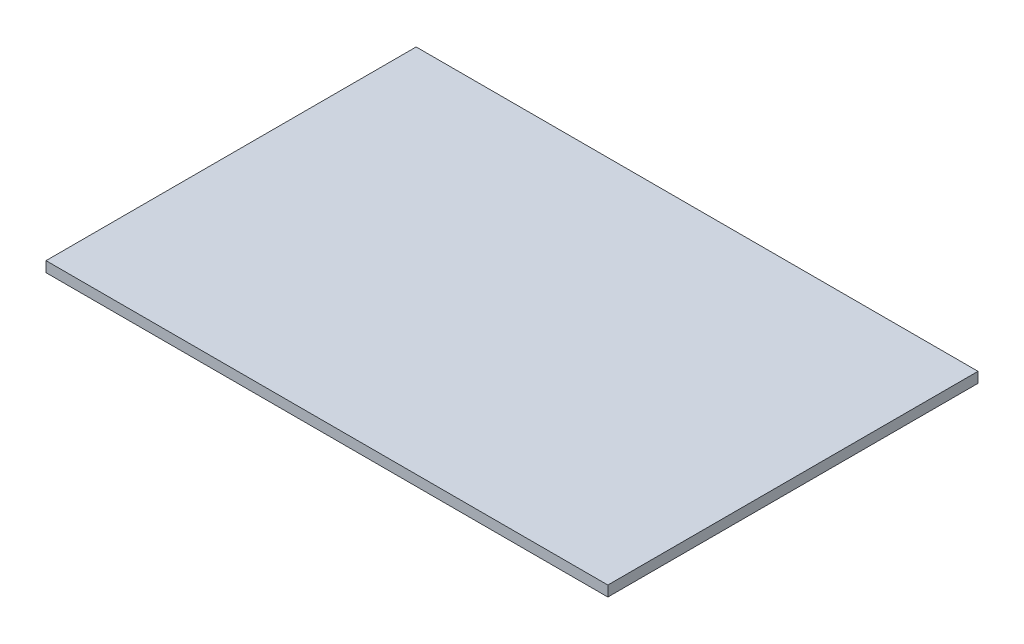
ISO-10303-21;
HEADER;
FILE_DESCRIPTION(('STEP AP214'),'2;1');
FILE_NAME('part.step','',(''),(''),'','','');
FILE_SCHEMA(('AUTOMOTIVE_DESIGN { 1 0 10303 214 1 1 1 1 }'));
ENDSEC;
DATA;
#1=APPLICATION_CONTEXT('core data for automotive mechanical design processes');
#2=APPLICATION_PROTOCOL_DEFINITION('international standard','automotive_design',2000,#1);
#3=PRODUCT_CONTEXT('',#1,'mechanical');
#4=PRODUCT('Part','Part','',(#3));
#5=PRODUCT_RELATED_PRODUCT_CATEGORY('part','',(#4));
#6=PRODUCT_DEFINITION_FORMATION('','',#4);
#7=PRODUCT_DEFINITION_CONTEXT('part definition',#1,'design');
#8=PRODUCT_DEFINITION('design','',#6,#7);
#9=PRODUCT_DEFINITION_SHAPE('','',#8);
#10=(LENGTH_UNIT() NAMED_UNIT(*) SI_UNIT(.MILLI.,.METRE.));
#11=(NAMED_UNIT(*) PLANE_ANGLE_UNIT() SI_UNIT($,.RADIAN.));
#12=(NAMED_UNIT(*) SI_UNIT($,.STERADIAN.) SOLID_ANGLE_UNIT());
#13=UNCERTAINTY_MEASURE_WITH_UNIT(LENGTH_MEASURE(1.E-05),#10,'distance_accuracy_value','');
#14=(GEOMETRIC_REPRESENTATION_CONTEXT(3) GLOBAL_UNCERTAINTY_ASSIGNED_CONTEXT((#13)) GLOBAL_UNIT_ASSIGNED_CONTEXT((#10,
#11,#12)) REPRESENTATION_CONTEXT('',''));
#15=CARTESIAN_POINT('',(0.,0.,0.));
#16=DIRECTION('',(0.,0.,1.));
#17=DIRECTION('',(1.,0.,0.));
#18=AXIS2_PLACEMENT_3D('',#15,#16,#17);
#19=CARTESIAN_POINT('',(-539.75,20.066,355.6));
#20=DIRECTION('',(1.,0.,0.));
#21=DIRECTION('',(0.,0.,-1.));
#22=AXIS2_PLACEMENT_3D('',#19,#20,#21);
#23=PLANE('',#22);
#24=DIRECTION('',(0.,0.,1.));
#25=VECTOR('',#24,1.);
#26=CARTESIAN_POINT('',(-539.75,0.,355.6));
#27=LINE('',#26,#25);
#28=CARTESIAN_POINT('',(-539.75,0.,-355.6));
#29=VERTEX_POINT('',#28);
#30=CARTESIAN_POINT('',(-539.75,0.,355.6));
#31=VERTEX_POINT('',#30);
#32=EDGE_CURVE('E99',#29,#31,#27,.T.);
#33=ORIENTED_EDGE('',*,*,#32,.T.);
#34=DIRECTION('',(0.,-1.,0.));
#35=VECTOR('',#34,1.);
#36=CARTESIAN_POINT('',(-539.75,20.066,355.6));
#37=LINE('',#36,#35);
#38=CARTESIAN_POINT('',(-539.75,20.066,355.6));
#39=VERTEX_POINT('',#38);
#40=EDGE_CURVE('E11',#39,#31,#37,.T.);
#41=ORIENTED_EDGE('',*,*,#40,.F.);
#42=DIRECTION('',(0.,0.,1.));
#43=VECTOR('',#42,1.);
#44=CARTESIAN_POINT('',(-539.75,20.066,355.6));
#45=LINE('',#44,#43);
#46=CARTESIAN_POINT('',(-539.75,20.066,-355.6));
#47=VERTEX_POINT('',#46);
#48=EDGE_CURVE('E87',#47,#39,#45,.T.);
#49=ORIENTED_EDGE('',*,*,#48,.F.);
#50=DIRECTION('',(0.,-1.,0.));
#51=VECTOR('',#50,1.);
#52=CARTESIAN_POINT('',(-539.75,20.066,-355.6));
#53=LINE('',#52,#51);
#54=EDGE_CURVE('E95',#47,#29,#53,.T.);
#55=ORIENTED_EDGE('',*,*,#54,.T.);
#56=EDGE_LOOP('',(#33,#41,#49,#55));
#57=FACE_BOUND('',#56,.T.);
#58=ADVANCED_FACE('F36',(#57),#23,.F.);
#59=CARTESIAN_POINT('',(539.75,20.066,355.6));
#60=DIRECTION('',(0.,0.,-1.));
#61=DIRECTION('',(-1.,0.,0.));
#62=AXIS2_PLACEMENT_3D('',#59,#60,#61);
#63=PLANE('',#62);
#64=DIRECTION('',(1.,0.,0.));
#65=VECTOR('',#64,1.);
#66=CARTESIAN_POINT('',(539.75,0.,355.6));
#67=LINE('',#66,#65);
#68=CARTESIAN_POINT('',(539.75,0.,355.6));
#69=VERTEX_POINT('',#68);
#70=EDGE_CURVE('E91',#31,#69,#67,.T.);
#71=ORIENTED_EDGE('',*,*,#70,.T.);
#72=DIRECTION('',(0.,-1.,0.));
#73=VECTOR('',#72,1.);
#74=CARTESIAN_POINT('',(539.75,20.066,355.6));
#75=LINE('',#74,#73);
#76=CARTESIAN_POINT('',(539.75,20.066,355.6));
#77=VERTEX_POINT('',#76);
#78=EDGE_CURVE('E44',#77,#69,#75,.T.);
#79=ORIENTED_EDGE('',*,*,#78,.F.);
#80=DIRECTION('',(1.,0.,0.));
#81=VECTOR('',#80,1.);
#82=CARTESIAN_POINT('',(539.75,20.066,355.6));
#83=LINE('',#82,#81);
#84=EDGE_CURVE('E82',#39,#77,#83,.T.);
#85=ORIENTED_EDGE('',*,*,#84,.F.);
#86=ORIENTED_EDGE('',*,*,#40,.T.);
#87=EDGE_LOOP('',(#71,#79,#85,#86));
#88=FACE_BOUND('',#87,.T.);
#89=ADVANCED_FACE('F90',(#88),#63,.F.);
#90=CARTESIAN_POINT('',(539.75,20.066,355.6));
#91=DIRECTION('',(-1.,0.,0.));
#92=DIRECTION('',(0.,0.,1.));
#93=AXIS2_PLACEMENT_3D('',#90,#91,#92);
#94=PLANE('',#93);
#95=DIRECTION('',(0.,0.,-1.));
#96=VECTOR('',#95,1.);
#97=CARTESIAN_POINT('',(539.75,0.,355.6));
#98=LINE('',#97,#96);
#99=CARTESIAN_POINT('',(539.75,0.,-355.6));
#100=VERTEX_POINT('',#99);
#101=EDGE_CURVE('E69',#69,#100,#98,.T.);
#102=ORIENTED_EDGE('',*,*,#101,.T.);
#103=DIRECTION('',(0.,-1.,0.));
#104=VECTOR('',#103,1.);
#105=CARTESIAN_POINT('',(539.75,20.066,-355.6));
#106=LINE('',#105,#104);
#107=CARTESIAN_POINT('',(539.75,20.066,-355.6));
#108=VERTEX_POINT('',#107);
#109=EDGE_CURVE('E92',#108,#100,#106,.T.);
#110=ORIENTED_EDGE('',*,*,#109,.F.);
#111=DIRECTION('',(0.,0.,-1.));
#112=VECTOR('',#111,1.);
#113=CARTESIAN_POINT('',(539.75,20.066,355.6));
#114=LINE('',#113,#112);
#115=EDGE_CURVE('E85',#77,#108,#114,.T.);
#116=ORIENTED_EDGE('',*,*,#115,.F.);
#117=ORIENTED_EDGE('',*,*,#78,.T.);
#118=EDGE_LOOP('',(#102,#110,#116,#117));
#119=FACE_BOUND('',#118,.T.);
#120=ADVANCED_FACE('F93',(#119),#94,.F.);
#121=CARTESIAN_POINT('',(539.75,20.066,-355.6));
#122=DIRECTION('',(0.,0.,1.));
#123=DIRECTION('',(1.,0.,0.));
#124=AXIS2_PLACEMENT_3D('',#121,#122,#123);
#125=PLANE('',#124);
#126=DIRECTION('',(-1.,0.,0.));
#127=VECTOR('',#126,1.);
#128=CARTESIAN_POINT('',(539.75,0.,-355.6));
#129=LINE('',#128,#127);
#130=EDGE_CURVE('E75',#100,#29,#129,.T.);
#131=ORIENTED_EDGE('',*,*,#130,.T.);
#132=ORIENTED_EDGE('',*,*,#54,.F.);
#133=DIRECTION('',(-1.,0.,0.));
#134=VECTOR('',#133,1.);
#135=CARTESIAN_POINT('',(539.75,20.066,-355.6));
#136=LINE('',#135,#134);
#137=EDGE_CURVE('E52',#108,#47,#136,.T.);
#138=ORIENTED_EDGE('',*,*,#137,.F.);
#139=ORIENTED_EDGE('',*,*,#109,.T.);
#140=EDGE_LOOP('',(#131,#132,#138,#139));
#141=FACE_BOUND('',#140,.T.);
#142=ADVANCED_FACE('F106',(#141),#125,.F.);
#143=CARTESIAN_POINT('',(0.,20.066,0.));
#144=DIRECTION('',(0.,1.,0.));
#145=DIRECTION('',(0.,0.,1.));
#146=AXIS2_PLACEMENT_3D('',#143,#144,#145);
#147=PLANE('',#146);
#148=ORIENTED_EDGE('',*,*,#48,.T.);
#149=ORIENTED_EDGE('',*,*,#84,.T.);
#150=ORIENTED_EDGE('',*,*,#115,.T.);
#151=ORIENTED_EDGE('',*,*,#137,.T.);
#152=EDGE_LOOP('',(#148,#149,#150,#151));
#153=FACE_BOUND('',#152,.T.);
#154=ADVANCED_FACE('F83',(#153),#147,.T.);
#155=CARTESIAN_POINT('',(0.,0.,0.));
#156=DIRECTION('',(0.,1.,0.));
#157=DIRECTION('',(0.,0.,1.));
#158=AXIS2_PLACEMENT_3D('',#155,#156,#157);
#159=PLANE('',#158);
#160=ORIENTED_EDGE('',*,*,#32,.F.);
#161=ORIENTED_EDGE('',*,*,#130,.F.);
#162=ORIENTED_EDGE('',*,*,#101,.F.);
#163=ORIENTED_EDGE('',*,*,#70,.F.);
#164=EDGE_LOOP('',(#160,#161,#162,#163));
#165=FACE_BOUND('',#164,.T.);
#166=ADVANCED_FACE('F109',(#165),#159,.F.);
#167=CLOSED_SHELL('',(#58,#89,#120,#142,#154,#166));
#168=MANIFOLD_SOLID_BREP('B2',#167);
#169=ADVANCED_BREP_SHAPE_REPRESENTATION('',(#18,#168),#14);
#170=SHAPE_DEFINITION_REPRESENTATION(#9,#169);
ENDSEC;
END-ISO-10303-21;
